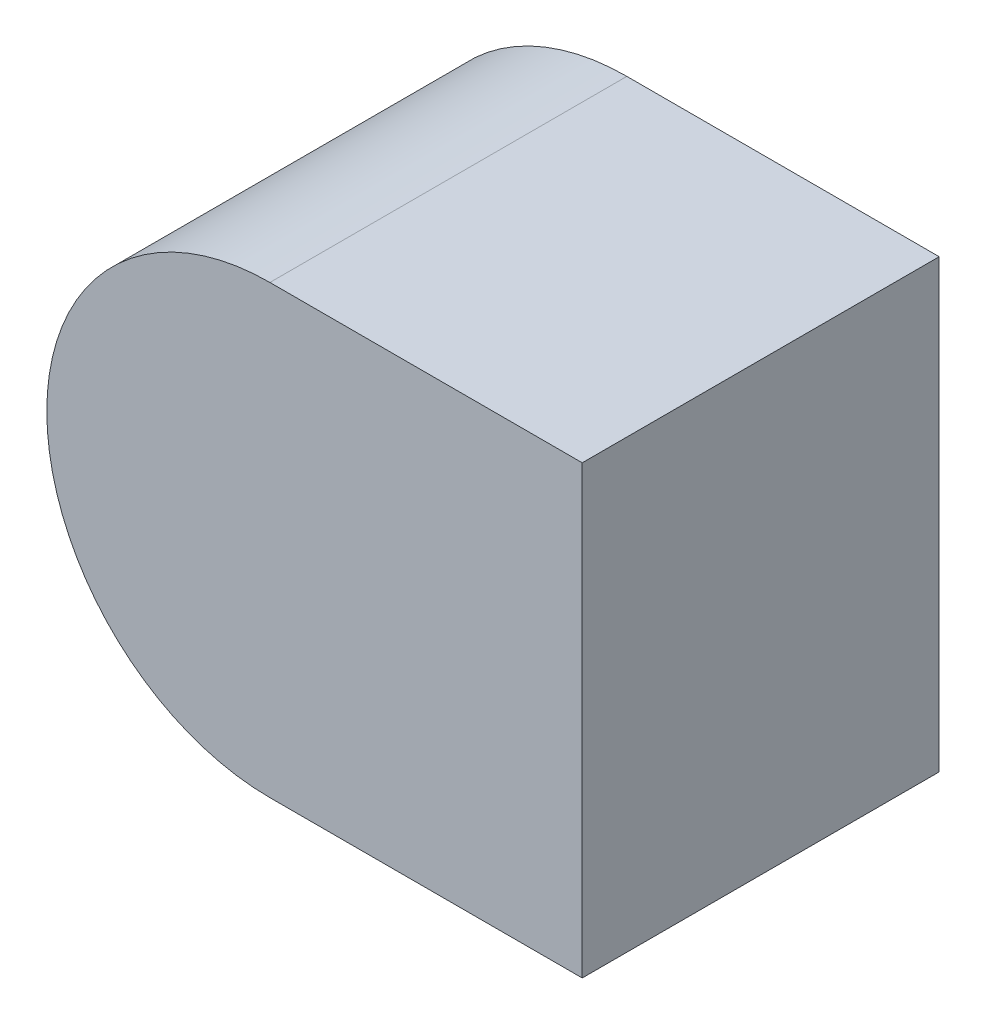
ISO-10303-21;
HEADER;
FILE_DESCRIPTION(('STEP AP214'),'2;1');
FILE_NAME('part.step','',(''),(''),'','','');
FILE_SCHEMA(('AUTOMOTIVE_DESIGN { 1 0 10303 214 1 1 1 1 }'));
ENDSEC;
DATA;
#1=APPLICATION_CONTEXT('core data for automotive mechanical design processes');
#2=APPLICATION_PROTOCOL_DEFINITION('international standard','automotive_design',2000,#1);
#3=PRODUCT_CONTEXT('',#1,'mechanical');
#4=PRODUCT('Part','Part','',(#3));
#5=PRODUCT_RELATED_PRODUCT_CATEGORY('part','',(#4));
#6=PRODUCT_DEFINITION_FORMATION('','',#4);
#7=PRODUCT_DEFINITION_CONTEXT('part definition',#1,'design');
#8=PRODUCT_DEFINITION('design','',#6,#7);
#9=PRODUCT_DEFINITION_SHAPE('','',#8);
#10=(LENGTH_UNIT() NAMED_UNIT(*) SI_UNIT(.MILLI.,.METRE.));
#11=(NAMED_UNIT(*) PLANE_ANGLE_UNIT() SI_UNIT($,.RADIAN.));
#12=(NAMED_UNIT(*) SI_UNIT($,.STERADIAN.) SOLID_ANGLE_UNIT());
#13=UNCERTAINTY_MEASURE_WITH_UNIT(LENGTH_MEASURE(1.E-05),#10,'distance_accuracy_value','');
#14=(GEOMETRIC_REPRESENTATION_CONTEXT(3) GLOBAL_UNCERTAINTY_ASSIGNED_CONTEXT((#13)) GLOBAL_UNIT_ASSIGNED_CONTEXT((#10,
#11,#12)) REPRESENTATION_CONTEXT('',''));
#15=CARTESIAN_POINT('',(0.,0.,0.));
#16=DIRECTION('',(0.,0.,1.));
#17=DIRECTION('',(1.,0.,0.));
#18=AXIS2_PLACEMENT_3D('',#15,#16,#17);
#19=CARTESIAN_POINT('',(0.703,0.875,0.));
#20=DIRECTION('',(0.,-1.,0.));
#21=DIRECTION('',(1.,0.,0.));
#22=AXIS2_PLACEMENT_3D('',#19,#20,#21);
#23=PLANE('',#22);
#24=DIRECTION('',(0.,0.,1.));
#25=VECTOR('',#24,1.);
#26=CARTESIAN_POINT('',(0.828,0.875,0.));
#27=LINE('',#26,#25);
#28=CARTESIAN_POINT('',(0.828,0.875,0.));
#29=VERTEX_POINT('',#28);
#30=CARTESIAN_POINT('',(0.828,0.875,0.2));
#31=VERTEX_POINT('',#30);
#32=EDGE_CURVE('E11',#29,#31,#27,.T.);
#33=ORIENTED_EDGE('',*,*,#32,.T.);
#34=DIRECTION('',(1.,0.,0.));
#35=VECTOR('',#34,1.);
#36=CARTESIAN_POINT('',(0.703,0.875,0.2));
#37=LINE('',#36,#35);
#38=CARTESIAN_POINT('',(1.003,0.875,0.2));
#39=VERTEX_POINT('',#38);
#40=EDGE_CURVE('E24',#31,#39,#37,.T.);
#41=ORIENTED_EDGE('',*,*,#40,.T.);
#42=DIRECTION('',(0.,0.,1.));
#43=VECTOR('',#42,1.);
#44=CARTESIAN_POINT('',(1.003,0.875,0.));
#45=LINE('',#44,#43);
#46=CARTESIAN_POINT('',(1.003,0.875,0.));
#47=VERTEX_POINT('',#46);
#48=EDGE_CURVE('E75',#47,#39,#45,.T.);
#49=ORIENTED_EDGE('',*,*,#48,.F.);
#50=DIRECTION('',(1.,0.,0.));
#51=VECTOR('',#50,1.);
#52=CARTESIAN_POINT('',(0.703,0.875,0.));
#53=LINE('',#52,#51);
#54=EDGE_CURVE('E86',#29,#47,#53,.T.);
#55=ORIENTED_EDGE('',*,*,#54,.F.);
#56=EDGE_LOOP('',(#33,#41,#49,#55));
#57=FACE_BOUND('',#56,.T.);
#58=ADVANCED_FACE('F17',(#57),#23,.F.);
#59=CARTESIAN_POINT('',(0.853,0.75,0.));
#60=DIRECTION('',(0.,0.,-1.));
#61=DIRECTION('',(-1.,0.,0.));
#62=AXIS2_PLACEMENT_3D('',#59,#60,#61);
#63=PLANE('',#62);
#64=CARTESIAN_POINT('',(0.828,0.75,0.));
#65=DIRECTION('',(0.,0.,-1.));
#66=DIRECTION('',(-0.707106781186548,0.707106781186547,0.));
#67=AXIS2_PLACEMENT_3D('',#64,#65,#66);
#68=CIRCLE('',#67,0.125);
#69=CARTESIAN_POINT('',(0.828,0.625,0.));
#70=VERTEX_POINT('',#69);
#71=EDGE_CURVE('E83',#70,#29,#68,.T.);
#72=ORIENTED_EDGE('',*,*,#71,.T.);
#73=ORIENTED_EDGE('',*,*,#54,.T.);
#74=DIRECTION('',(0.,-1.,0.));
#75=VECTOR('',#74,1.);
#76=CARTESIAN_POINT('',(1.003,0.875,0.));
#77=LINE('',#76,#75);
#78=CARTESIAN_POINT('',(1.003,0.625,0.));
#79=VERTEX_POINT('',#78);
#80=EDGE_CURVE('E81',#47,#79,#77,.T.);
#81=ORIENTED_EDGE('',*,*,#80,.T.);
#82=DIRECTION('',(-1.,0.,0.));
#83=VECTOR('',#82,1.);
#84=CARTESIAN_POINT('',(1.003,0.625,0.));
#85=LINE('',#84,#83);
#86=EDGE_CURVE('E60',#79,#70,#85,.T.);
#87=ORIENTED_EDGE('',*,*,#86,.T.);
#88=EDGE_LOOP('',(#72,#73,#81,#87));
#89=FACE_BOUND('',#88,.T.);
#90=ADVANCED_FACE('F91',(#89),#63,.T.);
#91=CARTESIAN_POINT('',(0.828,0.75,0.));
#92=DIRECTION('',(0.,0.,-1.));
#93=DIRECTION('',(-0.707106781186547,-0.707106781186548,0.));
#94=AXIS2_PLACEMENT_3D('',#91,#92,#93);
#95=CYLINDRICAL_SURFACE('',#94,0.125);
#96=CARTESIAN_POINT('',(0.828,0.75,0.2));
#97=DIRECTION('',(0.,0.,1.));
#98=DIRECTION('',(-0.707106781186548,0.707106781186547,0.));
#99=AXIS2_PLACEMENT_3D('',#96,#97,#98);
#100=CIRCLE('',#99,0.125);
#101=CARTESIAN_POINT('',(0.828,0.625,0.2));
#102=VERTEX_POINT('',#101);
#103=EDGE_CURVE('E70',#31,#102,#100,.T.);
#104=ORIENTED_EDGE('',*,*,#103,.F.);
#105=ORIENTED_EDGE('',*,*,#32,.F.);
#106=ORIENTED_EDGE('',*,*,#71,.F.);
#107=DIRECTION('',(0.,0.,-1.));
#108=VECTOR('',#107,1.);
#109=CARTESIAN_POINT('',(0.828,0.625,0.));
#110=LINE('',#109,#108);
#111=EDGE_CURVE('E64',#102,#70,#110,.T.);
#112=ORIENTED_EDGE('',*,*,#111,.F.);
#113=EDGE_LOOP('',(#104,#105,#106,#112));
#114=FACE_BOUND('',#113,.T.);
#115=ADVANCED_FACE('F89',(#114),#95,.T.);
#116=CARTESIAN_POINT('',(1.003,0.625,0.));
#117=DIRECTION('',(0.,1.,0.));
#118=DIRECTION('',(-1.,0.,0.));
#119=AXIS2_PLACEMENT_3D('',#116,#117,#118);
#120=PLANE('',#119);
#121=ORIENTED_EDGE('',*,*,#111,.T.);
#122=ORIENTED_EDGE('',*,*,#86,.F.);
#123=DIRECTION('',(0.,0.,1.));
#124=VECTOR('',#123,1.);
#125=CARTESIAN_POINT('',(1.003,0.625,0.));
#126=LINE('',#125,#124);
#127=CARTESIAN_POINT('',(1.003,0.625,0.2));
#128=VERTEX_POINT('',#127);
#129=EDGE_CURVE('E54',#79,#128,#126,.T.);
#130=ORIENTED_EDGE('',*,*,#129,.T.);
#131=DIRECTION('',(-1.,0.,0.));
#132=VECTOR('',#131,1.);
#133=CARTESIAN_POINT('',(1.003,0.625,0.2));
#134=LINE('',#133,#132);
#135=EDGE_CURVE('E58',#128,#102,#134,.T.);
#136=ORIENTED_EDGE('',*,*,#135,.T.);
#137=EDGE_LOOP('',(#121,#122,#130,#136));
#138=FACE_BOUND('',#137,.T.);
#139=ADVANCED_FACE('F57',(#138),#120,.F.);
#140=CARTESIAN_POINT('',(1.003,0.875,0.));
#141=DIRECTION('',(-1.,0.,0.));
#142=DIRECTION('',(0.,-1.,0.));
#143=AXIS2_PLACEMENT_3D('',#140,#141,#142);
#144=PLANE('',#143);
#145=ORIENTED_EDGE('',*,*,#80,.F.);
#146=ORIENTED_EDGE('',*,*,#48,.T.);
#147=DIRECTION('',(0.,-1.,0.));
#148=VECTOR('',#147,1.);
#149=CARTESIAN_POINT('',(1.003,0.875,0.2));
#150=LINE('',#149,#148);
#151=EDGE_CURVE('E69',#39,#128,#150,.T.);
#152=ORIENTED_EDGE('',*,*,#151,.T.);
#153=ORIENTED_EDGE('',*,*,#129,.F.);
#154=EDGE_LOOP('',(#145,#146,#152,#153));
#155=FACE_BOUND('',#154,.T.);
#156=ADVANCED_FACE('F74',(#155),#144,.F.);
#157=CARTESIAN_POINT('',(0.853,0.75,0.2));
#158=DIRECTION('',(0.,0.,-1.));
#159=DIRECTION('',(-1.,0.,0.));
#160=AXIS2_PLACEMENT_3D('',#157,#158,#159);
#161=PLANE('',#160);
#162=ORIENTED_EDGE('',*,*,#103,.T.);
#163=ORIENTED_EDGE('',*,*,#135,.F.);
#164=ORIENTED_EDGE('',*,*,#151,.F.);
#165=ORIENTED_EDGE('',*,*,#40,.F.);
#166=EDGE_LOOP('',(#162,#163,#164,#165));
#167=FACE_BOUND('',#166,.T.);
#168=ADVANCED_FACE('F68',(#167),#161,.F.);
#169=CLOSED_SHELL('',(#58,#90,#115,#139,#156,#168));
#170=MANIFOLD_SOLID_BREP('B1',#169);
#171=ADVANCED_BREP_SHAPE_REPRESENTATION('',(#18,#170),#14);
#172=SHAPE_DEFINITION_REPRESENTATION(#9,#171);
ENDSEC;
END-ISO-10303-21;
